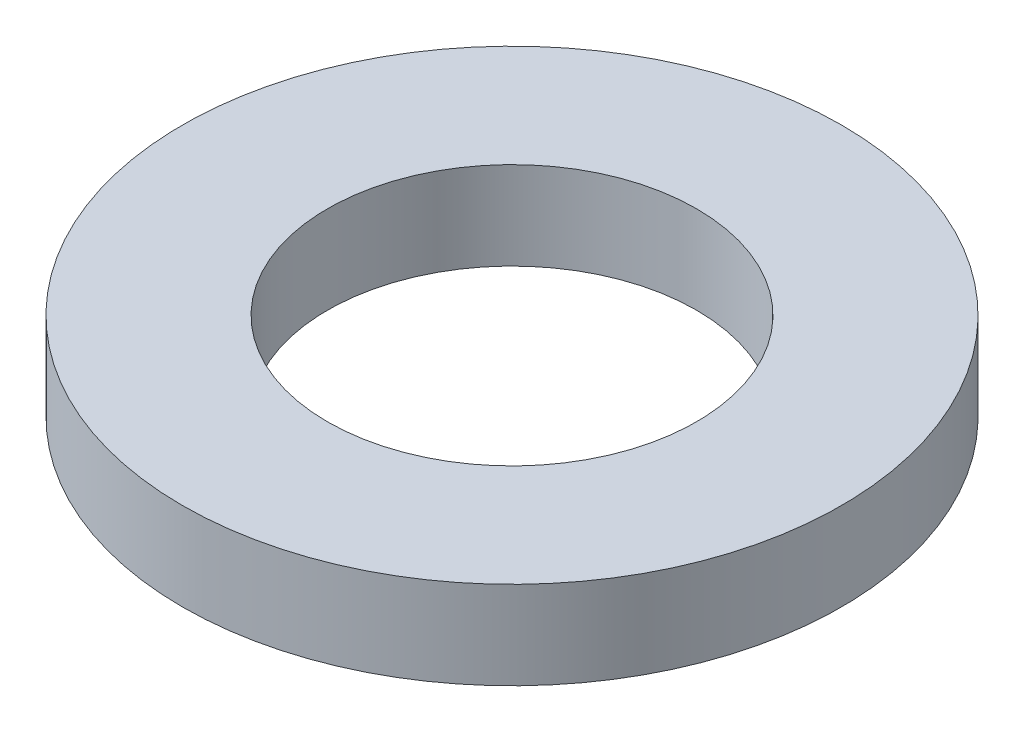
ISO-10303-21;
HEADER;
FILE_DESCRIPTION(('STEP AP214'),'2;1');
FILE_NAME('part.step','',(''),(''),'','','');
FILE_SCHEMA(('AUTOMOTIVE_DESIGN { 1 0 10303 214 1 1 1 1 }'));
ENDSEC;
DATA;
#1=APPLICATION_CONTEXT('core data for automotive mechanical design processes');
#2=APPLICATION_PROTOCOL_DEFINITION('international standard','automotive_design',2000,#1);
#3=PRODUCT_CONTEXT('',#1,'mechanical');
#4=PRODUCT('Part','Part','',(#3));
#5=PRODUCT_RELATED_PRODUCT_CATEGORY('part','',(#4));
#6=PRODUCT_DEFINITION_FORMATION('','',#4);
#7=PRODUCT_DEFINITION_CONTEXT('part definition',#1,'design');
#8=PRODUCT_DEFINITION('design','',#6,#7);
#9=PRODUCT_DEFINITION_SHAPE('','',#8);
#10=(LENGTH_UNIT() NAMED_UNIT(*) SI_UNIT(.MILLI.,.METRE.));
#11=(NAMED_UNIT(*) PLANE_ANGLE_UNIT() SI_UNIT($,.RADIAN.));
#12=(NAMED_UNIT(*) SI_UNIT($,.STERADIAN.) SOLID_ANGLE_UNIT());
#13=UNCERTAINTY_MEASURE_WITH_UNIT(LENGTH_MEASURE(1.E-05),#10,'distance_accuracy_value','');
#14=(GEOMETRIC_REPRESENTATION_CONTEXT(3) GLOBAL_UNCERTAINTY_ASSIGNED_CONTEXT((#13)) GLOBAL_UNIT_ASSIGNED_CONTEXT((#10,
#11,#12)) REPRESENTATION_CONTEXT('',''));
#15=CARTESIAN_POINT('',(0.,0.,0.));
#16=DIRECTION('',(0.,0.,1.));
#17=DIRECTION('',(1.,0.,0.));
#18=AXIS2_PLACEMENT_3D('',#15,#16,#17);
#19=CARTESIAN_POINT('',(0.,2.,0.));
#20=DIRECTION('',(0.,1.,0.));
#21=DIRECTION('',(0.,0.,1.));
#22=AXIS2_PLACEMENT_3D('',#19,#20,#21);
#23=PLANE('',#22);
#24=CARTESIAN_POINT('',(0.,2.,0.));
#25=DIRECTION('',(0.,1.,0.));
#26=DIRECTION('',(0.,0.,1.));
#27=AXIS2_PLACEMENT_3D('',#24,#25,#26);
#28=CIRCLE('',#27,7.5);
#29=CARTESIAN_POINT('',(0.,2.,7.5));
#30=VERTEX_POINT('',#29);
#31=EDGE_CURVE('E10',#30,#30,#28,.T.);
#32=ORIENTED_EDGE('',*,*,#31,.T.);
#33=EDGE_LOOP('',(#32));
#34=FACE_BOUND('',#33,.T.);
#35=CARTESIAN_POINT('',(0.,2.,0.));
#36=DIRECTION('',(0.,1.,0.));
#37=DIRECTION('',(0.,0.,1.));
#38=AXIS2_PLACEMENT_3D('',#35,#36,#37);
#39=CIRCLE('',#38,4.2);
#40=CARTESIAN_POINT('',(0.,2.,4.2));
#41=VERTEX_POINT('',#40);
#42=EDGE_CURVE('E48',#41,#41,#39,.T.);
#43=ORIENTED_EDGE('',*,*,#42,.F.);
#44=EDGE_LOOP('',(#43));
#45=FACE_BOUND('',#44,.T.);
#46=ADVANCED_FACE('F34',(#34,#45),#23,.T.);
#47=CARTESIAN_POINT('',(0.,0.,0.));
#48=DIRECTION('',(0.,1.,0.));
#49=DIRECTION('',(0.,0.,1.));
#50=AXIS2_PLACEMENT_3D('',#47,#48,#49);
#51=PLANE('',#50);
#52=CARTESIAN_POINT('',(0.,0.,0.));
#53=DIRECTION('',(0.,1.,0.));
#54=DIRECTION('',(0.,0.,1.));
#55=AXIS2_PLACEMENT_3D('',#52,#53,#54);
#56=CIRCLE('',#55,7.5);
#57=CARTESIAN_POINT('',(0.,0.,7.5));
#58=VERTEX_POINT('',#57);
#59=EDGE_CURVE('E38',#58,#58,#56,.T.);
#60=ORIENTED_EDGE('',*,*,#59,.F.);
#61=EDGE_LOOP('',(#60));
#62=FACE_BOUND('',#61,.T.);
#63=CARTESIAN_POINT('',(0.,0.,0.));
#64=DIRECTION('',(0.,1.,0.));
#65=DIRECTION('',(0.,0.,1.));
#66=AXIS2_PLACEMENT_3D('',#63,#64,#65);
#67=CIRCLE('',#66,4.2);
#68=CARTESIAN_POINT('',(0.,0.,4.2));
#69=VERTEX_POINT('',#68);
#70=EDGE_CURVE('E50',#69,#69,#67,.T.);
#71=ORIENTED_EDGE('',*,*,#70,.T.);
#72=EDGE_LOOP('',(#71));
#73=FACE_BOUND('',#72,.T.);
#74=ADVANCED_FACE('F60',(#62,#73),#51,.F.);
#75=CARTESIAN_POINT('',(0.,2.,0.));
#76=DIRECTION('',(0.,-1.,0.));
#77=DIRECTION('',(0.,0.,-1.));
#78=AXIS2_PLACEMENT_3D('',#75,#76,#77);
#79=CYLINDRICAL_SURFACE('',#78,7.5);
#80=ORIENTED_EDGE('',*,*,#31,.F.);
#81=EDGE_LOOP('',(#80));
#82=FACE_BOUND('',#81,.T.);
#83=ORIENTED_EDGE('',*,*,#59,.T.);
#84=EDGE_LOOP('',(#83));
#85=FACE_BOUND('',#84,.T.);
#86=ADVANCED_FACE('F36',(#82,#85),#79,.T.);
#87=CARTESIAN_POINT('',(0.,2.,0.));
#88=DIRECTION('',(0.,-1.,0.));
#89=DIRECTION('',(0.,0.,-1.));
#90=AXIS2_PLACEMENT_3D('',#87,#88,#89);
#91=CYLINDRICAL_SURFACE('',#90,4.2);
#92=ORIENTED_EDGE('',*,*,#42,.T.);
#93=EDGE_LOOP('',(#92));
#94=FACE_BOUND('',#93,.T.);
#95=ORIENTED_EDGE('',*,*,#70,.F.);
#96=EDGE_LOOP('',(#95));
#97=FACE_BOUND('',#96,.T.);
#98=ADVANCED_FACE('F56',(#94,#97),#91,.F.);
#99=CLOSED_SHELL('',(#46,#74,#86,#98));
#100=MANIFOLD_SOLID_BREP('B2',#99);
#101=ADVANCED_BREP_SHAPE_REPRESENTATION('',(#18,#100),#14);
#102=SHAPE_DEFINITION_REPRESENTATION(#9,#101);
ENDSEC;
END-ISO-10303-21;
